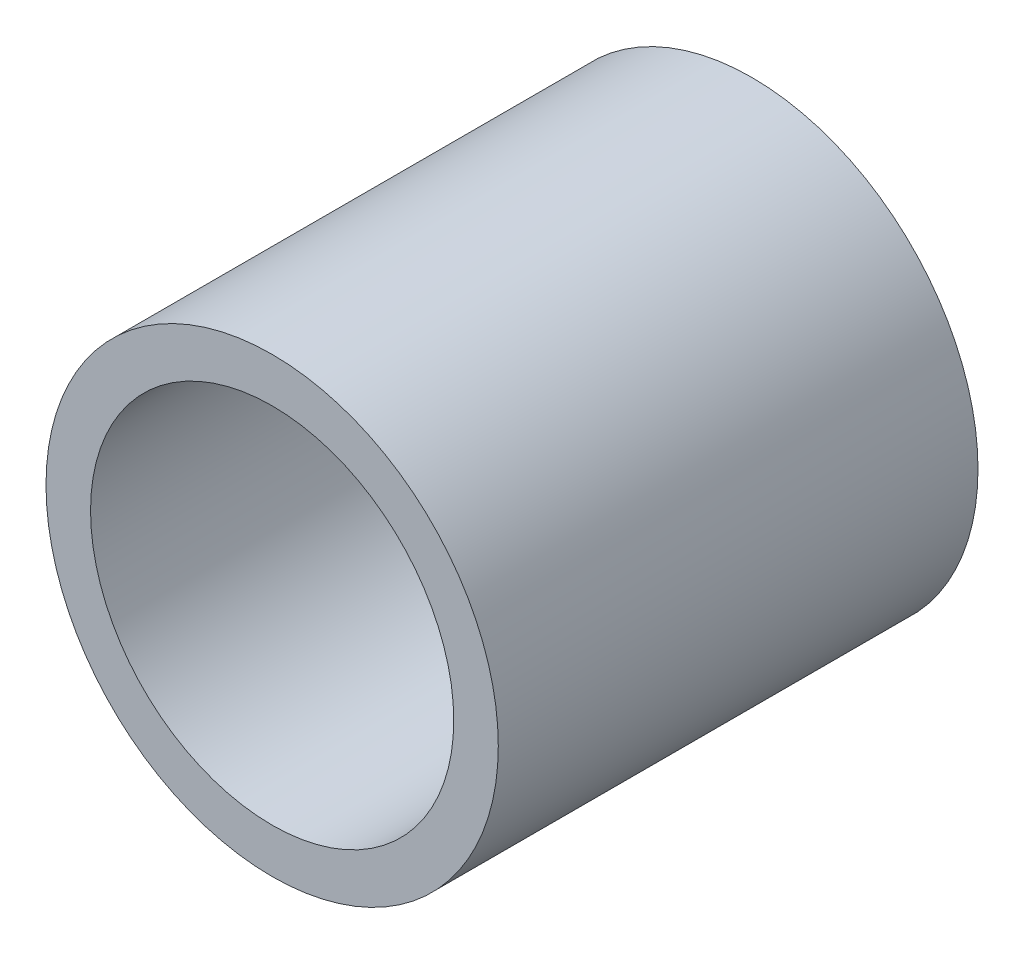
ISO-10303-21;
HEADER;
FILE_DESCRIPTION(('STEP AP214'),'2;1');
FILE_NAME('part.step','',(''),(''),'','','');
FILE_SCHEMA(('AUTOMOTIVE_DESIGN { 1 0 10303 214 1 1 1 1 }'));
ENDSEC;
DATA;
#1=APPLICATION_CONTEXT('core data for automotive mechanical design processes');
#2=APPLICATION_PROTOCOL_DEFINITION('international standard','automotive_design',2000,#1);
#3=PRODUCT_CONTEXT('',#1,'mechanical');
#4=PRODUCT('Part','Part','',(#3));
#5=PRODUCT_RELATED_PRODUCT_CATEGORY('part','',(#4));
#6=PRODUCT_DEFINITION_FORMATION('','',#4);
#7=PRODUCT_DEFINITION_CONTEXT('part definition',#1,'design');
#8=PRODUCT_DEFINITION('design','',#6,#7);
#9=PRODUCT_DEFINITION_SHAPE('','',#8);
#10=(LENGTH_UNIT() NAMED_UNIT(*) SI_UNIT(.MILLI.,.METRE.));
#11=(NAMED_UNIT(*) PLANE_ANGLE_UNIT() SI_UNIT($,.RADIAN.));
#12=(NAMED_UNIT(*) SI_UNIT($,.STERADIAN.) SOLID_ANGLE_UNIT());
#13=UNCERTAINTY_MEASURE_WITH_UNIT(LENGTH_MEASURE(1.E-05),#10,'distance_accuracy_value','');
#14=(GEOMETRIC_REPRESENTATION_CONTEXT(3) GLOBAL_UNCERTAINTY_ASSIGNED_CONTEXT((#13)) GLOBAL_UNIT_ASSIGNED_CONTEXT((#10,
#11,#12)) REPRESENTATION_CONTEXT('',''));
#15=CARTESIAN_POINT('',(0.,0.,0.));
#16=DIRECTION('',(0.,0.,1.));
#17=DIRECTION('',(1.,0.,0.));
#18=AXIS2_PLACEMENT_3D('',#15,#16,#17);
#19=CARTESIAN_POINT('',(0.,0.,35.));
#20=DIRECTION('',(0.,0.,-1.));
#21=DIRECTION('',(-1.,0.,0.));
#22=AXIS2_PLACEMENT_3D('',#19,#20,#21);
#23=CYLINDRICAL_SURFACE('',#22,16.5);
#24=CARTESIAN_POINT('',(0.,0.,35.));
#25=DIRECTION('',(0.,0.,1.));
#26=DIRECTION('',(1.,0.,0.));
#27=AXIS2_PLACEMENT_3D('',#24,#25,#26);
#28=CIRCLE('',#27,16.5);
#29=CARTESIAN_POINT('',(16.5,0.,35.));
#30=VERTEX_POINT('',#29);
#31=EDGE_CURVE('E10',#30,#30,#28,.T.);
#32=ORIENTED_EDGE('',*,*,#31,.F.);
#33=EDGE_LOOP('',(#32));
#34=FACE_BOUND('',#33,.T.);
#35=CARTESIAN_POINT('',(0.,0.,0.));
#36=DIRECTION('',(0.,0.,1.));
#37=DIRECTION('',(1.,0.,0.));
#38=AXIS2_PLACEMENT_3D('',#35,#36,#37);
#39=CIRCLE('',#38,16.5);
#40=CARTESIAN_POINT('',(16.5,0.,0.));
#41=VERTEX_POINT('',#40);
#42=EDGE_CURVE('E44',#41,#41,#39,.T.);
#43=ORIENTED_EDGE('',*,*,#42,.T.);
#44=EDGE_LOOP('',(#43));
#45=FACE_BOUND('',#44,.T.);
#46=ADVANCED_FACE('F41',(#34,#45),#23,.T.);
#47=CARTESIAN_POINT('',(0.,0.,35.));
#48=DIRECTION('',(0.,0.,1.));
#49=DIRECTION('',(1.,0.,0.));
#50=AXIS2_PLACEMENT_3D('',#47,#48,#49);
#51=PLANE('',#50);
#52=CARTESIAN_POINT('',(0.,0.,35.));
#53=DIRECTION('',(0.,0.,1.));
#54=DIRECTION('',(1.,0.,0.));
#55=AXIS2_PLACEMENT_3D('',#52,#53,#54);
#56=CIRCLE('',#55,13.25);
#57=CARTESIAN_POINT('',(13.25,0.,35.));
#58=VERTEX_POINT('',#57);
#59=EDGE_CURVE('E53',#58,#58,#56,.F.);
#60=ORIENTED_EDGE('',*,*,#59,.T.);
#61=EDGE_LOOP('',(#60));
#62=FACE_BOUND('',#61,.T.);
#63=ORIENTED_EDGE('',*,*,#31,.T.);
#64=EDGE_LOOP('',(#63));
#65=FACE_BOUND('',#64,.T.);
#66=ADVANCED_FACE('F69',(#62,#65),#51,.T.);
#67=CARTESIAN_POINT('',(0.,0.,0.));
#68=DIRECTION('',(0.,0.,1.));
#69=DIRECTION('',(1.,0.,0.));
#70=AXIS2_PLACEMENT_3D('',#67,#68,#69);
#71=PLANE('',#70);
#72=CARTESIAN_POINT('',(0.,0.,0.));
#73=DIRECTION('',(0.,0.,-1.));
#74=DIRECTION('',(-1.,0.,0.));
#75=AXIS2_PLACEMENT_3D('',#72,#73,#74);
#76=CIRCLE('',#75,13.25);
#77=CARTESIAN_POINT('',(-13.25,0.,0.));
#78=VERTEX_POINT('',#77);
#79=EDGE_CURVE('E58',#78,#78,#76,.T.);
#80=ORIENTED_EDGE('',*,*,#79,.F.);
#81=EDGE_LOOP('',(#80));
#82=FACE_BOUND('',#81,.T.);
#83=ORIENTED_EDGE('',*,*,#42,.F.);
#84=EDGE_LOOP('',(#83));
#85=FACE_BOUND('',#84,.T.);
#86=ADVANCED_FACE('F66',(#82,#85),#71,.F.);
#87=CARTESIAN_POINT('',(0.,0.,72.476659402887));
#88=DIRECTION('',(0.,0.,-1.));
#89=DIRECTION('',(-1.,0.,0.));
#90=AXIS2_PLACEMENT_3D('',#87,#88,#89);
#91=CYLINDRICAL_SURFACE('',#90,13.25);
#92=ORIENTED_EDGE('',*,*,#79,.T.);
#93=EDGE_LOOP('',(#92));
#94=FACE_BOUND('',#93,.T.);
#95=ORIENTED_EDGE('',*,*,#59,.F.);
#96=EDGE_LOOP('',(#95));
#97=FACE_BOUND('',#96,.T.);
#98=ADVANCED_FACE('F63',(#94,#97),#91,.F.);
#99=CLOSED_SHELL('',(#46,#66,#86,#98));
#100=MANIFOLD_SOLID_BREP('B2',#99);
#101=ADVANCED_BREP_SHAPE_REPRESENTATION('',(#18,#100),#14);
#102=SHAPE_DEFINITION_REPRESENTATION(#9,#101);
ENDSEC;
END-ISO-10303-21;
